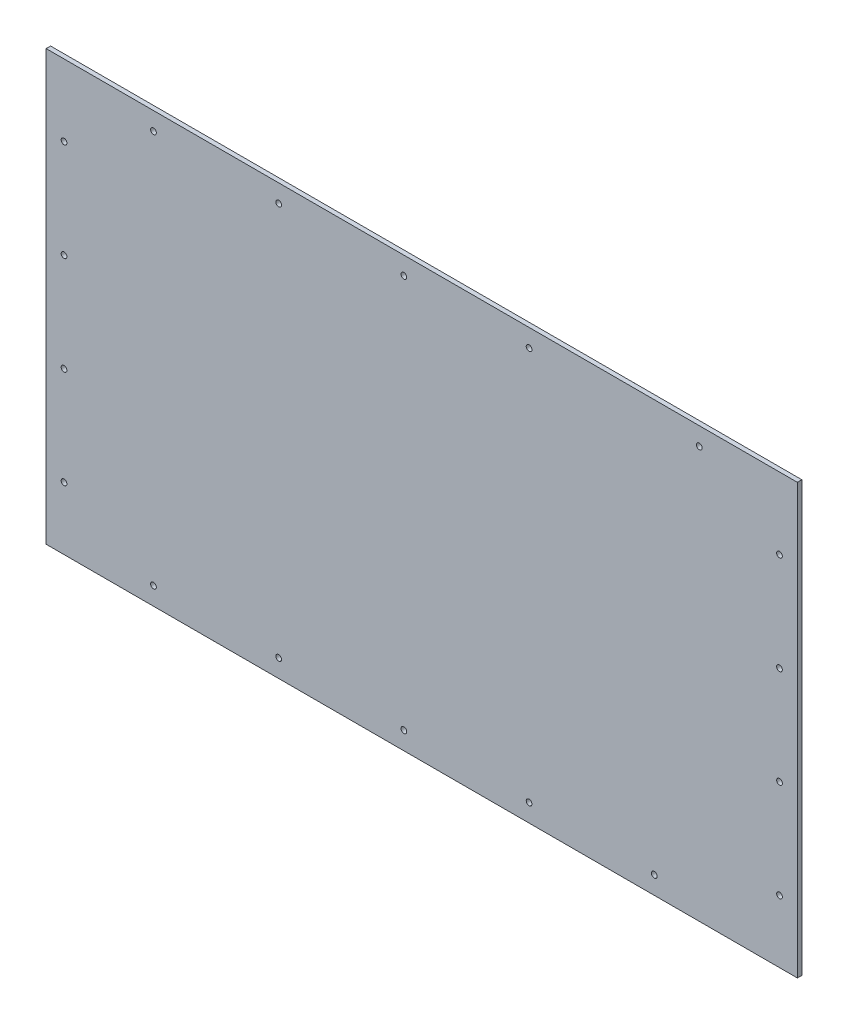
ISO-10303-21;
HEADER;
FILE_DESCRIPTION(('STEP AP214'),'2;1');
FILE_NAME('part.step','',(''),(''),'','','');
FILE_SCHEMA(('AUTOMOTIVE_DESIGN { 1 0 10303 214 1 1 1 1 }'));
ENDSEC;
DATA;
#1=APPLICATION_CONTEXT('core data for automotive mechanical design processes');
#2=APPLICATION_PROTOCOL_DEFINITION('international standard','automotive_design',2000,#1);
#3=PRODUCT_CONTEXT('',#1,'mechanical');
#4=PRODUCT('Part','Part','',(#3));
#5=PRODUCT_RELATED_PRODUCT_CATEGORY('part','',(#4));
#6=PRODUCT_DEFINITION_FORMATION('','',#4);
#7=PRODUCT_DEFINITION_CONTEXT('part definition',#1,'design');
#8=PRODUCT_DEFINITION('design','',#6,#7);
#9=PRODUCT_DEFINITION_SHAPE('','',#8);
#10=(LENGTH_UNIT() NAMED_UNIT(*) SI_UNIT(.MILLI.,.METRE.));
#11=(NAMED_UNIT(*) PLANE_ANGLE_UNIT() SI_UNIT($,.RADIAN.));
#12=(NAMED_UNIT(*) SI_UNIT($,.STERADIAN.) SOLID_ANGLE_UNIT());
#13=UNCERTAINTY_MEASURE_WITH_UNIT(LENGTH_MEASURE(1.E-05),#10,'distance_accuracy_value','');
#14=(GEOMETRIC_REPRESENTATION_CONTEXT(3) GLOBAL_UNCERTAINTY_ASSIGNED_CONTEXT((#13)) GLOBAL_UNIT_ASSIGNED_CONTEXT((#10,
#11,#12)) REPRESENTATION_CONTEXT('',''));
#15=CARTESIAN_POINT('',(0.,0.,0.));
#16=DIRECTION('',(0.,0.,1.));
#17=DIRECTION('',(1.,0.,0.));
#18=AXIS2_PLACEMENT_3D('',#15,#16,#17);
#19=CARTESIAN_POINT('',(533.4,0.,3.175));
#20=DIRECTION('',(-1.,0.,0.));
#21=DIRECTION('',(0.,0.,1.));
#22=AXIS2_PLACEMENT_3D('',#19,#20,#21);
#23=PLANE('',#22);
#24=DIRECTION('',(0.,1.,0.));
#25=VECTOR('',#24,1.);
#26=CARTESIAN_POINT('',(533.4,0.,0.));
#27=LINE('',#26,#25);
#28=CARTESIAN_POINT('',(533.4,0.,0.));
#29=VERTEX_POINT('',#28);
#30=CARTESIAN_POINT('',(533.4,304.8,0.));
#31=VERTEX_POINT('',#30);
#32=EDGE_CURVE('E99',#29,#31,#27,.T.);
#33=ORIENTED_EDGE('',*,*,#32,.T.);
#34=DIRECTION('',(0.,0.,-1.));
#35=VECTOR('',#34,1.);
#36=CARTESIAN_POINT('',(533.4,304.8,3.175));
#37=LINE('',#36,#35);
#38=CARTESIAN_POINT('',(533.4,304.8,3.175));
#39=VERTEX_POINT('',#38);
#40=EDGE_CURVE('E11',#39,#31,#37,.T.);
#41=ORIENTED_EDGE('',*,*,#40,.F.);
#42=DIRECTION('',(0.,1.,0.));
#43=VECTOR('',#42,1.);
#44=CARTESIAN_POINT('',(533.4,0.,3.175));
#45=LINE('',#44,#43);
#46=CARTESIAN_POINT('',(533.4,0.,3.175));
#47=VERTEX_POINT('',#46);
#48=EDGE_CURVE('E87',#47,#39,#45,.T.);
#49=ORIENTED_EDGE('',*,*,#48,.F.);
#50=DIRECTION('',(0.,0.,-1.));
#51=VECTOR('',#50,1.);
#52=CARTESIAN_POINT('',(533.4,0.,3.175));
#53=LINE('',#52,#51);
#54=EDGE_CURVE('E95',#47,#29,#53,.T.);
#55=ORIENTED_EDGE('',*,*,#54,.T.);
#56=EDGE_LOOP('',(#33,#41,#49,#55));
#57=FACE_BOUND('',#56,.T.);
#58=ADVANCED_FACE('F36',(#57),#23,.F.);
#59=CARTESIAN_POINT('',(533.4,304.8,3.175));
#60=DIRECTION('',(0.,-1.,0.));
#61=DIRECTION('',(0.,0.,-1.));
#62=AXIS2_PLACEMENT_3D('',#59,#60,#61);
#63=PLANE('',#62);
#64=DIRECTION('',(-1.,0.,0.));
#65=VECTOR('',#64,1.);
#66=CARTESIAN_POINT('',(533.4,304.8,0.));
#67=LINE('',#66,#65);
#68=CARTESIAN_POINT('',(0.,304.8,0.));
#69=VERTEX_POINT('',#68);
#70=EDGE_CURVE('E91',#31,#69,#67,.T.);
#71=ORIENTED_EDGE('',*,*,#70,.T.);
#72=DIRECTION('',(0.,0.,-1.));
#73=VECTOR('',#72,1.);
#74=CARTESIAN_POINT('',(0.,304.8,3.175));
#75=LINE('',#74,#73);
#76=CARTESIAN_POINT('',(0.,304.8,3.175));
#77=VERTEX_POINT('',#76);
#78=EDGE_CURVE('E44',#77,#69,#75,.T.);
#79=ORIENTED_EDGE('',*,*,#78,.F.);
#80=DIRECTION('',(-1.,0.,0.));
#81=VECTOR('',#80,1.);
#82=CARTESIAN_POINT('',(533.4,304.8,3.175));
#83=LINE('',#82,#81);
#84=EDGE_CURVE('E82',#39,#77,#83,.T.);
#85=ORIENTED_EDGE('',*,*,#84,.F.);
#86=ORIENTED_EDGE('',*,*,#40,.T.);
#87=EDGE_LOOP('',(#71,#79,#85,#86));
#88=FACE_BOUND('',#87,.T.);
#89=ADVANCED_FACE('F90',(#88),#63,.F.);
#90=CARTESIAN_POINT('',(0.,0.,3.175));
#91=DIRECTION('',(1.,0.,0.));
#92=DIRECTION('',(0.,0.,-1.));
#93=AXIS2_PLACEMENT_3D('',#90,#91,#92);
#94=PLANE('',#93);
#95=DIRECTION('',(0.,-1.,0.));
#96=VECTOR('',#95,1.);
#97=CARTESIAN_POINT('',(0.,0.,0.));
#98=LINE('',#97,#96);
#99=CARTESIAN_POINT('',(0.,0.,0.));
#100=VERTEX_POINT('',#99);
#101=EDGE_CURVE('E69',#69,#100,#98,.T.);
#102=ORIENTED_EDGE('',*,*,#101,.T.);
#103=DIRECTION('',(0.,0.,-1.));
#104=VECTOR('',#103,1.);
#105=CARTESIAN_POINT('',(0.,0.,3.175));
#106=LINE('',#105,#104);
#107=CARTESIAN_POINT('',(0.,0.,3.175));
#108=VERTEX_POINT('',#107);
#109=EDGE_CURVE('E92',#108,#100,#106,.T.);
#110=ORIENTED_EDGE('',*,*,#109,.F.);
#111=DIRECTION('',(0.,-1.,0.));
#112=VECTOR('',#111,1.);
#113=CARTESIAN_POINT('',(0.,0.,3.175));
#114=LINE('',#113,#112);
#115=EDGE_CURVE('E85',#77,#108,#114,.T.);
#116=ORIENTED_EDGE('',*,*,#115,.F.);
#117=ORIENTED_EDGE('',*,*,#78,.T.);
#118=EDGE_LOOP('',(#102,#110,#116,#117));
#119=FACE_BOUND('',#118,.T.);
#120=ADVANCED_FACE('F93',(#119),#94,.F.);
#121=CARTESIAN_POINT('',(533.4,0.,3.175));
#122=DIRECTION('',(0.,1.,0.));
#123=DIRECTION('',(-1.,0.,0.));
#124=AXIS2_PLACEMENT_3D('',#121,#122,#123);
#125=PLANE('',#124);
#126=DIRECTION('',(1.,0.,0.));
#127=VECTOR('',#126,1.);
#128=CARTESIAN_POINT('',(533.4,0.,0.));
#129=LINE('',#128,#127);
#130=EDGE_CURVE('E75',#100,#29,#129,.T.);
#131=ORIENTED_EDGE('',*,*,#130,.T.);
#132=ORIENTED_EDGE('',*,*,#54,.F.);
#133=DIRECTION('',(1.,0.,0.));
#134=VECTOR('',#133,1.);
#135=CARTESIAN_POINT('',(533.4,0.,3.175));
#136=LINE('',#135,#134);
#137=EDGE_CURVE('E52',#108,#47,#136,.T.);
#138=ORIENTED_EDGE('',*,*,#137,.F.);
#139=ORIENTED_EDGE('',*,*,#109,.T.);
#140=EDGE_LOOP('',(#131,#132,#138,#139));
#141=FACE_BOUND('',#140,.T.);
#142=ADVANCED_FACE('F107',(#141),#125,.F.);
#143=CARTESIAN_POINT('',(0.,0.,3.175));
#144=DIRECTION('',(0.,0.,1.));
#145=DIRECTION('',(1.,0.,0.));
#146=AXIS2_PLACEMENT_3D('',#143,#144,#145);
#147=PLANE('',#146);
#148=CARTESIAN_POINT('',(12.7000000000008,184.15,3.175));
#149=DIRECTION('',(0.,0.,1.));
#150=DIRECTION('',(1.,0.,0.));
#151=AXIS2_PLACEMENT_3D('',#148,#149,#150);
#152=CIRCLE('',#151,2.03200000000001);
#153=CARTESIAN_POINT('',(14.7320000000008,184.15,3.175));
#154=VERTEX_POINT('',#153);
#155=EDGE_CURVE('E198',#154,#154,#152,.T.);
#156=ORIENTED_EDGE('',*,*,#155,.F.);
#157=EDGE_LOOP('',(#156));
#158=FACE_BOUND('',#157,.T.);
#159=CARTESIAN_POINT('',(12.7000000000015,114.3,3.175));
#160=DIRECTION('',(0.,0.,1.));
#161=DIRECTION('',(1.,0.,0.));
#162=AXIS2_PLACEMENT_3D('',#159,#160,#161);
#163=CIRCLE('',#162,2.03200000000001);
#164=CARTESIAN_POINT('',(14.7320000000015,114.3,3.175));
#165=VERTEX_POINT('',#164);
#166=EDGE_CURVE('E192',#165,#165,#163,.T.);
#167=ORIENTED_EDGE('',*,*,#166,.F.);
#168=EDGE_LOOP('',(#167));
#169=FACE_BOUND('',#168,.T.);
#170=CARTESIAN_POINT('',(12.7000000000023,44.45,3.175));
#171=DIRECTION('',(0.,0.,1.));
#172=DIRECTION('',(1.,0.,0.));
#173=AXIS2_PLACEMENT_3D('',#170,#171,#172);
#174=CIRCLE('',#173,2.03200000000001);
#175=CARTESIAN_POINT('',(14.7320000000023,44.45,3.175));
#176=VERTEX_POINT('',#175);
#177=EDGE_CURVE('E186',#176,#176,#174,.T.);
#178=ORIENTED_EDGE('',*,*,#177,.F.);
#179=EDGE_LOOP('',(#178));
#180=FACE_BOUND('',#179,.T.);
#181=CARTESIAN_POINT('',(520.699999999998,44.4500000000001,3.175));
#182=DIRECTION('',(0.,0.,1.));
#183=DIRECTION('',(-1.,0.,0.));
#184=AXIS2_PLACEMENT_3D('',#181,#182,#183);
#185=CIRCLE('',#184,2.03200000000001);
#186=CARTESIAN_POINT('',(518.667999999998,44.4500000000001,3.175));
#187=VERTEX_POINT('',#186);
#188=EDGE_CURVE('E179',#187,#187,#185,.T.);
#189=ORIENTED_EDGE('',*,*,#188,.F.);
#190=EDGE_LOOP('',(#189));
#191=FACE_BOUND('',#190,.T.);
#192=CARTESIAN_POINT('',(520.699999999998,114.3,3.175));
#193=DIRECTION('',(0.,0.,1.));
#194=DIRECTION('',(-1.,0.,0.));
#195=AXIS2_PLACEMENT_3D('',#192,#193,#194);
#196=CIRCLE('',#195,2.03199999999989);
#197=CARTESIAN_POINT('',(518.667999999999,114.3,3.175));
#198=VERTEX_POINT('',#197);
#199=EDGE_CURVE('E215',#198,#198,#196,.T.);
#200=ORIENTED_EDGE('',*,*,#199,.F.);
#201=EDGE_LOOP('',(#200));
#202=FACE_BOUND('',#201,.T.);
#203=CARTESIAN_POINT('',(520.699999999999,184.15,3.175));
#204=DIRECTION('',(0.,0.,1.));
#205=DIRECTION('',(-1.,0.,0.));
#206=AXIS2_PLACEMENT_3D('',#203,#204,#205);
#207=CIRCLE('',#206,2.03200000000001);
#208=CARTESIAN_POINT('',(518.667999999999,184.15,3.175));
#209=VERTEX_POINT('',#208);
#210=EDGE_CURVE('E209',#209,#209,#207,.T.);
#211=ORIENTED_EDGE('',*,*,#210,.F.);
#212=EDGE_LOOP('',(#211));
#213=FACE_BOUND('',#212,.T.);
#214=CARTESIAN_POINT('',(520.7,254.,3.175));
#215=DIRECTION('',(0.,0.,1.));
#216=DIRECTION('',(-1.,0.,0.));
#217=AXIS2_PLACEMENT_3D('',#214,#215,#216);
#218=CIRCLE('',#217,2.03200000000001);
#219=CARTESIAN_POINT('',(518.668,254.,3.175));
#220=VERTEX_POINT('',#219);
#221=EDGE_CURVE('E203',#220,#220,#218,.T.);
#222=ORIENTED_EDGE('',*,*,#221,.F.);
#223=EDGE_LOOP('',(#222));
#224=FACE_BOUND('',#223,.T.);
#225=CARTESIAN_POINT('',(12.7,254.,3.175));
#226=DIRECTION('',(0.,0.,1.));
#227=DIRECTION('',(1.,0.,0.));
#228=AXIS2_PLACEMENT_3D('',#225,#226,#227);
#229=CIRCLE('',#228,2.03200000000002);
#230=CARTESIAN_POINT('',(14.7320000000001,254.,3.175));
#231=VERTEX_POINT('',#230);
#232=EDGE_CURVE('E173',#231,#231,#229,.T.);
#233=ORIENTED_EDGE('',*,*,#232,.F.);
#234=EDGE_LOOP('',(#233));
#235=FACE_BOUND('',#234,.T.);
#236=CARTESIAN_POINT('',(76.2,292.1,3.175));
#237=DIRECTION('',(0.,0.,1.));
#238=DIRECTION('',(-1.,0.,0.));
#239=AXIS2_PLACEMENT_3D('',#236,#237,#238);
#240=CIRCLE('',#239,2.03200000000001);
#241=CARTESIAN_POINT('',(74.168,292.1,3.175));
#242=VERTEX_POINT('',#241);
#243=EDGE_CURVE('E119',#242,#242,#240,.T.);
#244=ORIENTED_EDGE('',*,*,#243,.F.);
#245=EDGE_LOOP('',(#244));
#246=FACE_BOUND('',#245,.T.);
#247=CARTESIAN_POINT('',(165.1,292.1,3.175));
#248=DIRECTION('',(0.,0.,1.));
#249=DIRECTION('',(-1.,0.,0.));
#250=AXIS2_PLACEMENT_3D('',#247,#248,#249);
#251=CIRCLE('',#250,2.03200000000001);
#252=CARTESIAN_POINT('',(163.068,292.1,3.175));
#253=VERTEX_POINT('',#252);
#254=EDGE_CURVE('E126',#253,#253,#251,.T.);
#255=ORIENTED_EDGE('',*,*,#254,.F.);
#256=EDGE_LOOP('',(#255));
#257=FACE_BOUND('',#256,.T.);
#258=CARTESIAN_POINT('',(254.,292.1,3.175));
#259=DIRECTION('',(0.,0.,1.));
#260=DIRECTION('',(-1.,0.,0.));
#261=AXIS2_PLACEMENT_3D('',#258,#259,#260);
#262=CIRCLE('',#261,2.03200000000001);
#263=CARTESIAN_POINT('',(251.968,292.1,3.175));
#264=VERTEX_POINT('',#263);
#265=EDGE_CURVE('E132',#264,#264,#262,.T.);
#266=ORIENTED_EDGE('',*,*,#265,.F.);
#267=EDGE_LOOP('',(#266));
#268=FACE_BOUND('',#267,.T.);
#269=CARTESIAN_POINT('',(342.9,292.1,3.175));
#270=DIRECTION('',(0.,0.,1.));
#271=DIRECTION('',(-1.,0.,0.));
#272=AXIS2_PLACEMENT_3D('',#269,#270,#271);
#273=CIRCLE('',#272,2.03200000000001);
#274=CARTESIAN_POINT('',(340.868,292.1,3.175));
#275=VERTEX_POINT('',#274);
#276=EDGE_CURVE('E138',#275,#275,#273,.T.);
#277=ORIENTED_EDGE('',*,*,#276,.F.);
#278=EDGE_LOOP('',(#277));
#279=FACE_BOUND('',#278,.T.);
#280=CARTESIAN_POINT('',(463.719540128881,292.1,3.175));
#281=DIRECTION('',(0.,0.,1.));
#282=DIRECTION('',(-1.,0.,0.));
#283=AXIS2_PLACEMENT_3D('',#280,#281,#282);
#284=CIRCLE('',#283,2.03200000000001);
#285=CARTESIAN_POINT('',(461.687540128881,292.1,3.175));
#286=VERTEX_POINT('',#285);
#287=EDGE_CURVE('E144',#286,#286,#284,.T.);
#288=ORIENTED_EDGE('',*,*,#287,.F.);
#289=EDGE_LOOP('',(#288));
#290=FACE_BOUND('',#289,.T.);
#291=CARTESIAN_POINT('',(431.8,12.7,3.175));
#292=DIRECTION('',(0.,0.,1.));
#293=DIRECTION('',(1.,0.,0.));
#294=AXIS2_PLACEMENT_3D('',#291,#292,#293);
#295=CIRCLE('',#294,2.03200000000001);
#296=CARTESIAN_POINT('',(433.832,12.7,3.175));
#297=VERTEX_POINT('',#296);
#298=EDGE_CURVE('E150',#297,#297,#295,.T.);
#299=ORIENTED_EDGE('',*,*,#298,.F.);
#300=EDGE_LOOP('',(#299));
#301=FACE_BOUND('',#300,.T.);
#302=CARTESIAN_POINT('',(342.9,12.7,3.175));
#303=DIRECTION('',(0.,0.,1.));
#304=DIRECTION('',(1.,0.,0.));
#305=AXIS2_PLACEMENT_3D('',#302,#303,#304);
#306=CIRCLE('',#305,2.03200000000001);
#307=CARTESIAN_POINT('',(344.932,12.7,3.175));
#308=VERTEX_POINT('',#307);
#309=EDGE_CURVE('E156',#308,#308,#306,.T.);
#310=ORIENTED_EDGE('',*,*,#309,.F.);
#311=EDGE_LOOP('',(#310));
#312=FACE_BOUND('',#311,.T.);
#313=CARTESIAN_POINT('',(254.,12.7,3.175));
#314=DIRECTION('',(0.,0.,1.));
#315=DIRECTION('',(1.,0.,0.));
#316=AXIS2_PLACEMENT_3D('',#313,#314,#315);
#317=CIRCLE('',#316,2.03200000000001);
#318=CARTESIAN_POINT('',(256.032,12.7,3.175));
#319=VERTEX_POINT('',#318);
#320=EDGE_CURVE('E162',#319,#319,#317,.T.);
#321=ORIENTED_EDGE('',*,*,#320,.F.);
#322=EDGE_LOOP('',(#321));
#323=FACE_BOUND('',#322,.T.);
#324=CARTESIAN_POINT('',(165.1,12.7,3.175));
#325=DIRECTION('',(0.,0.,1.));
#326=DIRECTION('',(1.,0.,0.));
#327=AXIS2_PLACEMENT_3D('',#324,#325,#326);
#328=CIRCLE('',#327,2.03200000000001);
#329=CARTESIAN_POINT('',(167.132,12.7,3.175));
#330=VERTEX_POINT('',#329);
#331=EDGE_CURVE('E168',#330,#330,#328,.T.);
#332=ORIENTED_EDGE('',*,*,#331,.F.);
#333=EDGE_LOOP('',(#332));
#334=FACE_BOUND('',#333,.T.);
#335=CARTESIAN_POINT('',(76.2,12.7,3.175));
#336=DIRECTION('',(0.,0.,1.));
#337=DIRECTION('',(1.,0.,0.));
#338=AXIS2_PLACEMENT_3D('',#335,#336,#337);
#339=CIRCLE('',#338,2.03200000000001);
#340=CARTESIAN_POINT('',(78.2320000000001,12.7,3.175));
#341=VERTEX_POINT('',#340);
#342=EDGE_CURVE('E113',#341,#341,#339,.T.);
#343=ORIENTED_EDGE('',*,*,#342,.F.);
#344=EDGE_LOOP('',(#343));
#345=FACE_BOUND('',#344,.T.);
#346=ORIENTED_EDGE('',*,*,#48,.T.);
#347=ORIENTED_EDGE('',*,*,#84,.T.);
#348=ORIENTED_EDGE('',*,*,#115,.T.);
#349=ORIENTED_EDGE('',*,*,#137,.T.);
#350=EDGE_LOOP('',(#346,#347,#348,#349));
#351=FACE_BOUND('',#350,.T.);
#352=ADVANCED_FACE('F83',(#158,#169,#180,#191,#202,#213,#224,#235,#246,#257,#268,#279,#290,#301,
#312,#323,#334,#345,#351),#147,.T.);
#353=CARTESIAN_POINT('',(0.,0.,0.));
#354=DIRECTION('',(0.,0.,1.));
#355=DIRECTION('',(1.,0.,0.));
#356=AXIS2_PLACEMENT_3D('',#353,#354,#355);
#357=PLANE('',#356);
#358=CARTESIAN_POINT('',(12.7000000000008,184.15,0.));
#359=DIRECTION('',(0.,0.,1.));
#360=DIRECTION('',(1.,0.,0.));
#361=AXIS2_PLACEMENT_3D('',#358,#359,#360);
#362=CIRCLE('',#361,2.03200000000001);
#363=CARTESIAN_POINT('',(14.7320000000008,184.15,0.));
#364=VERTEX_POINT('',#363);
#365=EDGE_CURVE('E176',#364,#364,#362,.T.);
#366=ORIENTED_EDGE('',*,*,#365,.T.);
#367=EDGE_LOOP('',(#366));
#368=FACE_BOUND('',#367,.T.);
#369=CARTESIAN_POINT('',(12.7000000000015,114.3,0.));
#370=DIRECTION('',(0.,0.,1.));
#371=DIRECTION('',(1.,0.,0.));
#372=AXIS2_PLACEMENT_3D('',#369,#370,#371);
#373=CIRCLE('',#372,2.03200000000001);
#374=CARTESIAN_POINT('',(14.7320000000015,114.3,0.));
#375=VERTEX_POINT('',#374);
#376=EDGE_CURVE('E195',#375,#375,#373,.T.);
#377=ORIENTED_EDGE('',*,*,#376,.T.);
#378=EDGE_LOOP('',(#377));
#379=FACE_BOUND('',#378,.T.);
#380=CARTESIAN_POINT('',(12.7000000000023,44.45,0.));
#381=DIRECTION('',(0.,0.,1.));
#382=DIRECTION('',(1.,0.,0.));
#383=AXIS2_PLACEMENT_3D('',#380,#381,#382);
#384=CIRCLE('',#383,2.03200000000001);
#385=CARTESIAN_POINT('',(14.7320000000023,44.45,0.));
#386=VERTEX_POINT('',#385);
#387=EDGE_CURVE('E189',#386,#386,#384,.T.);
#388=ORIENTED_EDGE('',*,*,#387,.T.);
#389=EDGE_LOOP('',(#388));
#390=FACE_BOUND('',#389,.T.);
#391=CARTESIAN_POINT('',(520.699999999998,44.4500000000001,0.));
#392=DIRECTION('',(0.,0.,1.));
#393=DIRECTION('',(-1.,0.,0.));
#394=AXIS2_PLACEMENT_3D('',#391,#392,#393);
#395=CIRCLE('',#394,2.03200000000001);
#396=CARTESIAN_POINT('',(518.667999999998,44.4500000000001,0.));
#397=VERTEX_POINT('',#396);
#398=EDGE_CURVE('E182',#397,#397,#395,.T.);
#399=ORIENTED_EDGE('',*,*,#398,.T.);
#400=EDGE_LOOP('',(#399));
#401=FACE_BOUND('',#400,.T.);
#402=CARTESIAN_POINT('',(520.699999999998,114.3,0.));
#403=DIRECTION('',(0.,0.,1.));
#404=DIRECTION('',(-1.,0.,0.));
#405=AXIS2_PLACEMENT_3D('',#402,#403,#404);
#406=CIRCLE('',#405,2.03199999999989);
#407=CARTESIAN_POINT('',(518.667999999999,114.3,0.));
#408=VERTEX_POINT('',#407);
#409=EDGE_CURVE('E183',#408,#408,#406,.T.);
#410=ORIENTED_EDGE('',*,*,#409,.T.);
#411=EDGE_LOOP('',(#410));
#412=FACE_BOUND('',#411,.T.);
#413=CARTESIAN_POINT('',(520.699999999999,184.15,0.));
#414=DIRECTION('',(0.,0.,1.));
#415=DIRECTION('',(-1.,0.,0.));
#416=AXIS2_PLACEMENT_3D('',#413,#414,#415);
#417=CIRCLE('',#416,2.03200000000001);
#418=CARTESIAN_POINT('',(518.667999999999,184.15,0.));
#419=VERTEX_POINT('',#418);
#420=EDGE_CURVE('E212',#419,#419,#417,.T.);
#421=ORIENTED_EDGE('',*,*,#420,.T.);
#422=EDGE_LOOP('',(#421));
#423=FACE_BOUND('',#422,.T.);
#424=CARTESIAN_POINT('',(520.7,254.,0.));
#425=DIRECTION('',(0.,0.,1.));
#426=DIRECTION('',(-1.,0.,0.));
#427=AXIS2_PLACEMENT_3D('',#424,#425,#426);
#428=CIRCLE('',#427,2.03200000000001);
#429=CARTESIAN_POINT('',(518.668,254.,0.));
#430=VERTEX_POINT('',#429);
#431=EDGE_CURVE('E206',#430,#430,#428,.T.);
#432=ORIENTED_EDGE('',*,*,#431,.T.);
#433=EDGE_LOOP('',(#432));
#434=FACE_BOUND('',#433,.T.);
#435=CARTESIAN_POINT('',(12.7,254.,0.));
#436=DIRECTION('',(0.,0.,1.));
#437=DIRECTION('',(1.,0.,0.));
#438=AXIS2_PLACEMENT_3D('',#435,#436,#437);
#439=CIRCLE('',#438,2.03200000000002);
#440=CARTESIAN_POINT('',(14.7320000000001,254.,0.));
#441=VERTEX_POINT('',#440);
#442=EDGE_CURVE('E123',#441,#441,#439,.T.);
#443=ORIENTED_EDGE('',*,*,#442,.T.);
#444=EDGE_LOOP('',(#443));
#445=FACE_BOUND('',#444,.T.);
#446=CARTESIAN_POINT('',(76.2,292.1,0.));
#447=DIRECTION('',(0.,0.,1.));
#448=DIRECTION('',(-1.,0.,0.));
#449=AXIS2_PLACEMENT_3D('',#446,#447,#448);
#450=CIRCLE('',#449,2.03200000000001);
#451=CARTESIAN_POINT('',(74.168,292.1,0.));
#452=VERTEX_POINT('',#451);
#453=EDGE_CURVE('E122',#452,#452,#450,.T.);
#454=ORIENTED_EDGE('',*,*,#453,.T.);
#455=EDGE_LOOP('',(#454));
#456=FACE_BOUND('',#455,.T.);
#457=CARTESIAN_POINT('',(165.1,292.1,0.));
#458=DIRECTION('',(0.,0.,1.));
#459=DIRECTION('',(-1.,0.,0.));
#460=AXIS2_PLACEMENT_3D('',#457,#458,#459);
#461=CIRCLE('',#460,2.03200000000001);
#462=CARTESIAN_POINT('',(163.068,292.1,0.));
#463=VERTEX_POINT('',#462);
#464=EDGE_CURVE('E129',#463,#463,#461,.T.);
#465=ORIENTED_EDGE('',*,*,#464,.T.);
#466=EDGE_LOOP('',(#465));
#467=FACE_BOUND('',#466,.T.);
#468=CARTESIAN_POINT('',(254.,292.1,0.));
#469=DIRECTION('',(0.,0.,1.));
#470=DIRECTION('',(-1.,0.,0.));
#471=AXIS2_PLACEMENT_3D('',#468,#469,#470);
#472=CIRCLE('',#471,2.03200000000001);
#473=CARTESIAN_POINT('',(251.968,292.1,0.));
#474=VERTEX_POINT('',#473);
#475=EDGE_CURVE('E135',#474,#474,#472,.T.);
#476=ORIENTED_EDGE('',*,*,#475,.T.);
#477=EDGE_LOOP('',(#476));
#478=FACE_BOUND('',#477,.T.);
#479=CARTESIAN_POINT('',(342.9,292.1,0.));
#480=DIRECTION('',(0.,0.,1.));
#481=DIRECTION('',(-1.,0.,0.));
#482=AXIS2_PLACEMENT_3D('',#479,#480,#481);
#483=CIRCLE('',#482,2.03200000000001);
#484=CARTESIAN_POINT('',(340.868,292.1,0.));
#485=VERTEX_POINT('',#484);
#486=EDGE_CURVE('E141',#485,#485,#483,.T.);
#487=ORIENTED_EDGE('',*,*,#486,.T.);
#488=EDGE_LOOP('',(#487));
#489=FACE_BOUND('',#488,.T.);
#490=CARTESIAN_POINT('',(463.719540128881,292.1,0.));
#491=DIRECTION('',(0.,0.,1.));
#492=DIRECTION('',(-1.,0.,0.));
#493=AXIS2_PLACEMENT_3D('',#490,#491,#492);
#494=CIRCLE('',#493,2.03200000000001);
#495=CARTESIAN_POINT('',(461.687540128881,292.1,0.));
#496=VERTEX_POINT('',#495);
#497=EDGE_CURVE('E147',#496,#496,#494,.T.);
#498=ORIENTED_EDGE('',*,*,#497,.T.);
#499=EDGE_LOOP('',(#498));
#500=FACE_BOUND('',#499,.T.);
#501=CARTESIAN_POINT('',(431.8,12.7,0.));
#502=DIRECTION('',(0.,0.,1.));
#503=DIRECTION('',(1.,0.,0.));
#504=AXIS2_PLACEMENT_3D('',#501,#502,#503);
#505=CIRCLE('',#504,2.03200000000001);
#506=CARTESIAN_POINT('',(433.832,12.7,0.));
#507=VERTEX_POINT('',#506);
#508=EDGE_CURVE('E153',#507,#507,#505,.T.);
#509=ORIENTED_EDGE('',*,*,#508,.T.);
#510=EDGE_LOOP('',(#509));
#511=FACE_BOUND('',#510,.T.);
#512=CARTESIAN_POINT('',(342.9,12.7,0.));
#513=DIRECTION('',(0.,0.,1.));
#514=DIRECTION('',(1.,0.,0.));
#515=AXIS2_PLACEMENT_3D('',#512,#513,#514);
#516=CIRCLE('',#515,2.03200000000001);
#517=CARTESIAN_POINT('',(344.932,12.7,0.));
#518=VERTEX_POINT('',#517);
#519=EDGE_CURVE('E159',#518,#518,#516,.T.);
#520=ORIENTED_EDGE('',*,*,#519,.T.);
#521=EDGE_LOOP('',(#520));
#522=FACE_BOUND('',#521,.T.);
#523=CARTESIAN_POINT('',(254.,12.7,0.));
#524=DIRECTION('',(0.,0.,1.));
#525=DIRECTION('',(1.,0.,0.));
#526=AXIS2_PLACEMENT_3D('',#523,#524,#525);
#527=CIRCLE('',#526,2.03200000000001);
#528=CARTESIAN_POINT('',(256.032,12.7,0.));
#529=VERTEX_POINT('',#528);
#530=EDGE_CURVE('E165',#529,#529,#527,.T.);
#531=ORIENTED_EDGE('',*,*,#530,.T.);
#532=EDGE_LOOP('',(#531));
#533=FACE_BOUND('',#532,.T.);
#534=CARTESIAN_POINT('',(165.1,12.7,0.));
#535=DIRECTION('',(0.,0.,1.));
#536=DIRECTION('',(1.,0.,0.));
#537=AXIS2_PLACEMENT_3D('',#534,#535,#536);
#538=CIRCLE('',#537,2.03200000000001);
#539=CARTESIAN_POINT('',(167.132,12.7,0.));
#540=VERTEX_POINT('',#539);
#541=EDGE_CURVE('E116',#540,#540,#538,.T.);
#542=ORIENTED_EDGE('',*,*,#541,.T.);
#543=EDGE_LOOP('',(#542));
#544=FACE_BOUND('',#543,.T.);
#545=CARTESIAN_POINT('',(76.2,12.7,0.));
#546=DIRECTION('',(0.,0.,1.));
#547=DIRECTION('',(1.,0.,0.));
#548=AXIS2_PLACEMENT_3D('',#545,#546,#547);
#549=CIRCLE('',#548,2.03200000000001);
#550=CARTESIAN_POINT('',(78.2320000000001,12.7,0.));
#551=VERTEX_POINT('',#550);
#552=EDGE_CURVE('E102',#551,#551,#549,.T.);
#553=ORIENTED_EDGE('',*,*,#552,.T.);
#554=EDGE_LOOP('',(#553));
#555=FACE_BOUND('',#554,.T.);
#556=ORIENTED_EDGE('',*,*,#32,.F.);
#557=ORIENTED_EDGE('',*,*,#130,.F.);
#558=ORIENTED_EDGE('',*,*,#101,.F.);
#559=ORIENTED_EDGE('',*,*,#70,.F.);
#560=EDGE_LOOP('',(#556,#557,#558,#559));
#561=FACE_BOUND('',#560,.T.);
#562=ADVANCED_FACE('F110',(#368,#379,#390,#401,#412,#423,#434,#445,#456,#467,#478,#489,#500,
#511,#522,#533,#544,#555,#561),#357,.F.);
#563=CARTESIAN_POINT('',(76.2,12.7,0.));
#564=DIRECTION('',(0.,0.,1.));
#565=DIRECTION('',(1.,0.,0.));
#566=AXIS2_PLACEMENT_3D('',#563,#564,#565);
#567=CYLINDRICAL_SURFACE('',#566,2.03200000000001);
#568=ORIENTED_EDGE('',*,*,#552,.F.);
#569=EDGE_LOOP('',(#568));
#570=FACE_BOUND('',#569,.T.);
#571=ORIENTED_EDGE('',*,*,#342,.T.);
#572=EDGE_LOOP('',(#571));
#573=FACE_BOUND('',#572,.T.);
#574=ADVANCED_FACE('F261',(#570,#573),#567,.F.);
#575=CARTESIAN_POINT('',(165.1,12.7,0.));
#576=DIRECTION('',(0.,0.,1.));
#577=DIRECTION('',(1.,0.,0.));
#578=AXIS2_PLACEMENT_3D('',#575,#576,#577);
#579=CYLINDRICAL_SURFACE('',#578,2.03200000000001);
#580=ORIENTED_EDGE('',*,*,#541,.F.);
#581=EDGE_LOOP('',(#580));
#582=FACE_BOUND('',#581,.T.);
#583=ORIENTED_EDGE('',*,*,#331,.T.);
#584=EDGE_LOOP('',(#583));
#585=FACE_BOUND('',#584,.T.);
#586=ADVANCED_FACE('F263',(#582,#585),#579,.F.);
#587=CARTESIAN_POINT('',(254.,12.7,0.));
#588=DIRECTION('',(0.,0.,1.));
#589=DIRECTION('',(1.,0.,0.));
#590=AXIS2_PLACEMENT_3D('',#587,#588,#589);
#591=CYLINDRICAL_SURFACE('',#590,2.03200000000001);
#592=ORIENTED_EDGE('',*,*,#530,.F.);
#593=EDGE_LOOP('',(#592));
#594=FACE_BOUND('',#593,.T.);
#595=ORIENTED_EDGE('',*,*,#320,.T.);
#596=EDGE_LOOP('',(#595));
#597=FACE_BOUND('',#596,.T.);
#598=ADVANCED_FACE('F270',(#594,#597),#591,.F.);
#599=CARTESIAN_POINT('',(342.9,12.7,0.));
#600=DIRECTION('',(0.,0.,1.));
#601=DIRECTION('',(1.,0.,0.));
#602=AXIS2_PLACEMENT_3D('',#599,#600,#601);
#603=CYLINDRICAL_SURFACE('',#602,2.03200000000001);
#604=ORIENTED_EDGE('',*,*,#519,.F.);
#605=EDGE_LOOP('',(#604));
#606=FACE_BOUND('',#605,.T.);
#607=ORIENTED_EDGE('',*,*,#309,.T.);
#608=EDGE_LOOP('',(#607));
#609=FACE_BOUND('',#608,.T.);
#610=ADVANCED_FACE('F387',(#606,#609),#603,.F.);
#611=CARTESIAN_POINT('',(431.8,12.7,0.));
#612=DIRECTION('',(0.,0.,1.));
#613=DIRECTION('',(1.,0.,0.));
#614=AXIS2_PLACEMENT_3D('',#611,#612,#613);
#615=CYLINDRICAL_SURFACE('',#614,2.03200000000001);
#616=ORIENTED_EDGE('',*,*,#508,.F.);
#617=EDGE_LOOP('',(#616));
#618=FACE_BOUND('',#617,.T.);
#619=ORIENTED_EDGE('',*,*,#298,.T.);
#620=EDGE_LOOP('',(#619));
#621=FACE_BOUND('',#620,.T.);
#622=ADVANCED_FACE('F391',(#618,#621),#615,.F.);
#623=CARTESIAN_POINT('',(463.719540128881,292.1,0.));
#624=DIRECTION('',(0.,0.,1.));
#625=DIRECTION('',(1.,0.,0.));
#626=AXIS2_PLACEMENT_3D('',#623,#624,#625);
#627=CYLINDRICAL_SURFACE('',#626,2.03200000000001);
#628=ORIENTED_EDGE('',*,*,#497,.F.);
#629=EDGE_LOOP('',(#628));
#630=FACE_BOUND('',#629,.T.);
#631=ORIENTED_EDGE('',*,*,#287,.T.);
#632=EDGE_LOOP('',(#631));
#633=FACE_BOUND('',#632,.T.);
#634=ADVANCED_FACE('F395',(#630,#633),#627,.F.);
#635=CARTESIAN_POINT('',(342.9,292.1,0.));
#636=DIRECTION('',(0.,0.,1.));
#637=DIRECTION('',(1.,0.,0.));
#638=AXIS2_PLACEMENT_3D('',#635,#636,#637);
#639=CYLINDRICAL_SURFACE('',#638,2.03200000000001);
#640=ORIENTED_EDGE('',*,*,#486,.F.);
#641=EDGE_LOOP('',(#640));
#642=FACE_BOUND('',#641,.T.);
#643=ORIENTED_EDGE('',*,*,#276,.T.);
#644=EDGE_LOOP('',(#643));
#645=FACE_BOUND('',#644,.T.);
#646=ADVANCED_FACE('F399',(#642,#645),#639,.F.);
#647=CARTESIAN_POINT('',(254.,292.1,0.));
#648=DIRECTION('',(0.,0.,1.));
#649=DIRECTION('',(1.,0.,0.));
#650=AXIS2_PLACEMENT_3D('',#647,#648,#649);
#651=CYLINDRICAL_SURFACE('',#650,2.03200000000001);
#652=ORIENTED_EDGE('',*,*,#475,.F.);
#653=EDGE_LOOP('',(#652));
#654=FACE_BOUND('',#653,.T.);
#655=ORIENTED_EDGE('',*,*,#265,.T.);
#656=EDGE_LOOP('',(#655));
#657=FACE_BOUND('',#656,.T.);
#658=ADVANCED_FACE('F403',(#654,#657),#651,.F.);
#659=CARTESIAN_POINT('',(165.1,292.1,0.));
#660=DIRECTION('',(0.,0.,1.));
#661=DIRECTION('',(1.,0.,0.));
#662=AXIS2_PLACEMENT_3D('',#659,#660,#661);
#663=CYLINDRICAL_SURFACE('',#662,2.03200000000001);
#664=ORIENTED_EDGE('',*,*,#464,.F.);
#665=EDGE_LOOP('',(#664));
#666=FACE_BOUND('',#665,.T.);
#667=ORIENTED_EDGE('',*,*,#254,.T.);
#668=EDGE_LOOP('',(#667));
#669=FACE_BOUND('',#668,.T.);
#670=ADVANCED_FACE('F407',(#666,#669),#663,.F.);
#671=CARTESIAN_POINT('',(76.2,292.1,0.));
#672=DIRECTION('',(0.,0.,1.));
#673=DIRECTION('',(1.,0.,0.));
#674=AXIS2_PLACEMENT_3D('',#671,#672,#673);
#675=CYLINDRICAL_SURFACE('',#674,2.03200000000001);
#676=ORIENTED_EDGE('',*,*,#453,.F.);
#677=EDGE_LOOP('',(#676));
#678=FACE_BOUND('',#677,.T.);
#679=ORIENTED_EDGE('',*,*,#243,.T.);
#680=EDGE_LOOP('',(#679));
#681=FACE_BOUND('',#680,.T.);
#682=ADVANCED_FACE('F312',(#678,#681),#675,.F.);
#683=CARTESIAN_POINT('',(12.7,254.,0.));
#684=DIRECTION('',(0.,0.,1.));
#685=DIRECTION('',(1.,0.,0.));
#686=AXIS2_PLACEMENT_3D('',#683,#684,#685);
#687=CYLINDRICAL_SURFACE('',#686,2.03200000000002);
#688=ORIENTED_EDGE('',*,*,#442,.F.);
#689=EDGE_LOOP('',(#688));
#690=FACE_BOUND('',#689,.T.);
#691=ORIENTED_EDGE('',*,*,#232,.T.);
#692=EDGE_LOOP('',(#691));
#693=FACE_BOUND('',#692,.T.);
#694=ADVANCED_FACE('F306',(#690,#693),#687,.F.);
#695=CARTESIAN_POINT('',(520.7,254.,0.));
#696=DIRECTION('',(0.,0.,1.));
#697=DIRECTION('',(1.,0.,0.));
#698=AXIS2_PLACEMENT_3D('',#695,#696,#697);
#699=CYLINDRICAL_SURFACE('',#698,2.03200000000001);
#700=ORIENTED_EDGE('',*,*,#431,.F.);
#701=EDGE_LOOP('',(#700));
#702=FACE_BOUND('',#701,.T.);
#703=ORIENTED_EDGE('',*,*,#221,.T.);
#704=EDGE_LOOP('',(#703));
#705=FACE_BOUND('',#704,.T.);
#706=ADVANCED_FACE('F311',(#702,#705),#699,.F.);
#707=CARTESIAN_POINT('',(520.699999999999,184.15,0.));
#708=DIRECTION('',(0.,0.,1.));
#709=DIRECTION('',(1.,0.,0.));
#710=AXIS2_PLACEMENT_3D('',#707,#708,#709);
#711=CYLINDRICAL_SURFACE('',#710,2.03200000000001);
#712=ORIENTED_EDGE('',*,*,#420,.F.);
#713=EDGE_LOOP('',(#712));
#714=FACE_BOUND('',#713,.T.);
#715=ORIENTED_EDGE('',*,*,#210,.T.);
#716=EDGE_LOOP('',(#715));
#717=FACE_BOUND('',#716,.T.);
#718=ADVANCED_FACE('F227',(#714,#717),#711,.F.);
#719=CARTESIAN_POINT('',(520.699999999998,114.3,0.));
#720=DIRECTION('',(0.,0.,1.));
#721=DIRECTION('',(1.,0.,0.));
#722=AXIS2_PLACEMENT_3D('',#719,#720,#721);
#723=CYLINDRICAL_SURFACE('',#722,2.03199999999989);
#724=ORIENTED_EDGE('',*,*,#409,.F.);
#725=EDGE_LOOP('',(#724));
#726=FACE_BOUND('',#725,.T.);
#727=ORIENTED_EDGE('',*,*,#199,.T.);
#728=EDGE_LOOP('',(#727));
#729=FACE_BOUND('',#728,.T.);
#730=ADVANCED_FACE('F223',(#726,#729),#723,.F.);
#731=CARTESIAN_POINT('',(520.699999999998,44.4500000000001,0.));
#732=DIRECTION('',(0.,0.,1.));
#733=DIRECTION('',(1.,0.,0.));
#734=AXIS2_PLACEMENT_3D('',#731,#732,#733);
#735=CYLINDRICAL_SURFACE('',#734,2.03200000000001);
#736=ORIENTED_EDGE('',*,*,#398,.F.);
#737=EDGE_LOOP('',(#736));
#738=FACE_BOUND('',#737,.T.);
#739=ORIENTED_EDGE('',*,*,#188,.T.);
#740=EDGE_LOOP('',(#739));
#741=FACE_BOUND('',#740,.T.);
#742=ADVANCED_FACE('F226',(#738,#741),#735,.F.);
#743=CARTESIAN_POINT('',(12.7000000000023,44.45,0.));
#744=DIRECTION('',(0.,0.,1.));
#745=DIRECTION('',(1.,0.,0.));
#746=AXIS2_PLACEMENT_3D('',#743,#744,#745);
#747=CYLINDRICAL_SURFACE('',#746,2.03200000000001);
#748=ORIENTED_EDGE('',*,*,#387,.F.);
#749=EDGE_LOOP('',(#748));
#750=FACE_BOUND('',#749,.T.);
#751=ORIENTED_EDGE('',*,*,#177,.T.);
#752=EDGE_LOOP('',(#751));
#753=FACE_BOUND('',#752,.T.);
#754=ADVANCED_FACE('F348',(#750,#753),#747,.F.);
#755=CARTESIAN_POINT('',(12.7000000000015,114.3,0.));
#756=DIRECTION('',(0.,0.,1.));
#757=DIRECTION('',(1.,0.,0.));
#758=AXIS2_PLACEMENT_3D('',#755,#756,#757);
#759=CYLINDRICAL_SURFACE('',#758,2.03200000000001);
#760=ORIENTED_EDGE('',*,*,#376,.F.);
#761=EDGE_LOOP('',(#760));
#762=FACE_BOUND('',#761,.T.);
#763=ORIENTED_EDGE('',*,*,#166,.T.);
#764=EDGE_LOOP('',(#763));
#765=FACE_BOUND('',#764,.T.);
#766=ADVANCED_FACE('F358',(#762,#765),#759,.F.);
#767=CARTESIAN_POINT('',(12.7000000000008,184.15,0.));
#768=DIRECTION('',(0.,0.,1.));
#769=DIRECTION('',(1.,0.,0.));
#770=AXIS2_PLACEMENT_3D('',#767,#768,#769);
#771=CYLINDRICAL_SURFACE('',#770,2.03200000000001);
#772=ORIENTED_EDGE('',*,*,#365,.F.);
#773=EDGE_LOOP('',(#772));
#774=FACE_BOUND('',#773,.T.);
#775=ORIENTED_EDGE('',*,*,#155,.T.);
#776=EDGE_LOOP('',(#775));
#777=FACE_BOUND('',#776,.T.);
#778=ADVANCED_FACE('F368',(#774,#777),#771,.F.);
#779=CLOSED_SHELL('',(#58,#89,#120,#142,#352,#562,#574,#586,#598,#610,#622,#634,#646,#658,#670,
#682,#694,#706,#718,#730,#742,#754,#766,#778));
#780=MANIFOLD_SOLID_BREP('B2',#779);
#781=ADVANCED_BREP_SHAPE_REPRESENTATION('',(#18,#780),#14);
#782=SHAPE_DEFINITION_REPRESENTATION(#9,#781);
ENDSEC;
END-ISO-10303-21;
